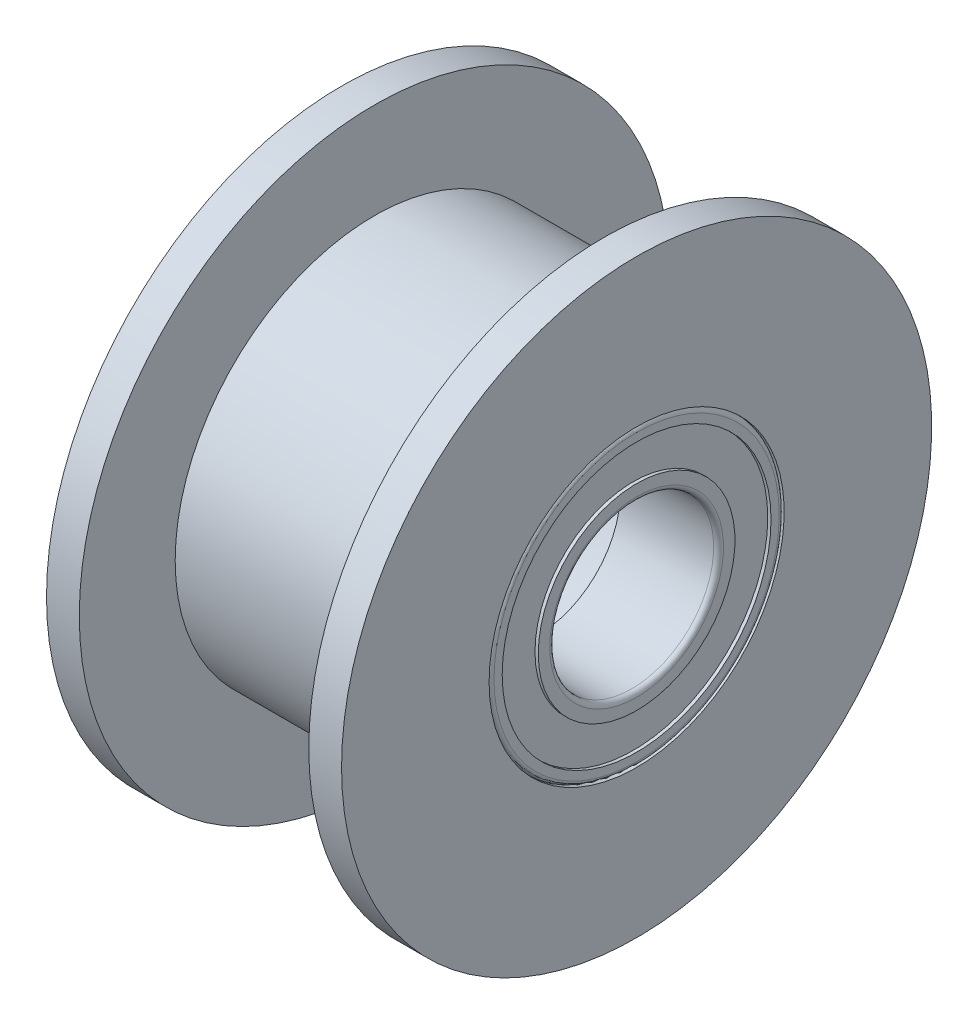
ISO-10303-21;
HEADER;
FILE_DESCRIPTION(('STEP AP214'),'2;1');
FILE_NAME('part.step','',(''),(''),'','','');
FILE_SCHEMA(('AUTOMOTIVE_DESIGN { 1 0 10303 214 1 1 1 1 }'));
ENDSEC;
DATA;
#1=APPLICATION_CONTEXT('core data for automotive mechanical design processes');
#2=APPLICATION_PROTOCOL_DEFINITION('international standard','automotive_design',2000,#1);
#3=PRODUCT_CONTEXT('',#1,'mechanical');
#4=PRODUCT('Part','Part','',(#3));
#5=PRODUCT_RELATED_PRODUCT_CATEGORY('part','',(#4));
#6=PRODUCT_DEFINITION_FORMATION('','',#4);
#7=PRODUCT_DEFINITION_CONTEXT('part definition',#1,'design');
#8=PRODUCT_DEFINITION('design','',#6,#7);
#9=PRODUCT_DEFINITION_SHAPE('','',#8);
#10=(LENGTH_UNIT() NAMED_UNIT(*) SI_UNIT(.MILLI.,.METRE.));
#11=(NAMED_UNIT(*) PLANE_ANGLE_UNIT() SI_UNIT($,.RADIAN.));
#12=(NAMED_UNIT(*) SI_UNIT($,.STERADIAN.) SOLID_ANGLE_UNIT());
#13=UNCERTAINTY_MEASURE_WITH_UNIT(LENGTH_MEASURE(1.E-05),#10,'distance_accuracy_value','');
#14=(GEOMETRIC_REPRESENTATION_CONTEXT(3) GLOBAL_UNCERTAINTY_ASSIGNED_CONTEXT((#13)) GLOBAL_UNIT_ASSIGNED_CONTEXT((#10,
#11,#12)) REPRESENTATION_CONTEXT('',''));
#15=CARTESIAN_POINT('',(0.,0.,0.));
#16=DIRECTION('',(0.,0.,1.));
#17=DIRECTION('',(1.,0.,0.));
#18=AXIS2_PLACEMENT_3D('',#15,#16,#17);
#19=CARTESIAN_POINT('',(-4.35,0.,0.));
#20=DIRECTION('',(1.,0.,0.));
#21=DIRECTION('',(0.,0.,1.));
#22=AXIS2_PLACEMENT_3D('',#19,#20,#21);
#23=TOROIDAL_SURFACE('',#22,2.65,0.15);
#24=CARTESIAN_POINT('',(-4.5,0.,0.));
#25=DIRECTION('',(-1.,0.,0.));
#26=DIRECTION('',(0.,0.,1.));
#27=AXIS2_PLACEMENT_3D('',#24,#25,#26);
#28=CIRCLE('',#27,2.65);
#29=CARTESIAN_POINT('',(-4.5,0.,2.65));
#30=VERTEX_POINT('',#29);
#31=EDGE_CURVE('E187',#30,#30,#28,.T.);
#32=ORIENTED_EDGE('',*,*,#31,.T.);
#33=EDGE_LOOP('',(#32));
#34=FACE_BOUND('',#33,.T.);
#35=CARTESIAN_POINT('',(-4.35,0.,0.));
#36=DIRECTION('',(1.,0.,0.));
#37=DIRECTION('',(0.,0.,1.));
#38=AXIS2_PLACEMENT_3D('',#35,#36,#37);
#39=CIRCLE('',#38,2.5);
#40=CARTESIAN_POINT('',(-4.35,0.,2.5));
#41=VERTEX_POINT('',#40);
#42=EDGE_CURVE('E195',#41,#41,#39,.T.);
#43=ORIENTED_EDGE('',*,*,#42,.T.);
#44=EDGE_LOOP('',(#43));
#45=FACE_BOUND('',#44,.T.);
#46=ADVANCED_FACE('F17',(#34,#45),#23,.T.);
#47=CARTESIAN_POINT('',(-4.5,0.,6.75));
#48=DIRECTION('',(1.,0.,0.));
#49=DIRECTION('',(0.,1.,0.));
#50=AXIS2_PLACEMENT_3D('',#47,#48,#49);
#51=PLANE('',#50);
#52=CARTESIAN_POINT('',(-4.5,0.,0.));
#53=DIRECTION('',(-1.,0.,0.));
#54=DIRECTION('',(0.,0.,1.));
#55=AXIS2_PLACEMENT_3D('',#52,#53,#54);
#56=CIRCLE('',#55,4.5);
#57=CARTESIAN_POINT('',(-4.5,0.,4.5));
#58=VERTEX_POINT('',#57);
#59=EDGE_CURVE('E11',#58,#58,#56,.T.);
#60=ORIENTED_EDGE('',*,*,#59,.F.);
#61=EDGE_LOOP('',(#60));
#62=FACE_BOUND('',#61,.T.);
#63=CARTESIAN_POINT('',(-4.5,0.,0.));
#64=DIRECTION('',(-1.,0.,0.));
#65=DIRECTION('',(0.,0.,1.));
#66=AXIS2_PLACEMENT_3D('',#63,#64,#65);
#67=CIRCLE('',#66,9.);
#68=CARTESIAN_POINT('',(-4.5,0.,9.));
#69=VERTEX_POINT('',#68);
#70=EDGE_CURVE('E172',#69,#69,#67,.T.);
#71=ORIENTED_EDGE('',*,*,#70,.T.);
#72=EDGE_LOOP('',(#71));
#73=FACE_BOUND('',#72,.T.);
#74=ADVANCED_FACE('F19',(#62,#73),#51,.F.);
#75=CARTESIAN_POINT('',(-2.25,0.,0.));
#76=DIRECTION('',(1.,0.,0.));
#77=DIRECTION('',(0.,0.,1.));
#78=AXIS2_PLACEMENT_3D('',#75,#76,#77);
#79=CYLINDRICAL_SURFACE('',#78,4.5);
#80=CARTESIAN_POINT('',(-4.35,0.,0.));
#81=DIRECTION('',(-1.,0.,0.));
#82=DIRECTION('',(0.,0.,1.));
#83=AXIS2_PLACEMENT_3D('',#80,#81,#82);
#84=CIRCLE('',#83,4.5);
#85=CARTESIAN_POINT('',(-4.35,0.,4.5));
#86=VERTEX_POINT('',#85);
#87=EDGE_CURVE('E28',#86,#86,#84,.T.);
#88=ORIENTED_EDGE('',*,*,#87,.F.);
#89=EDGE_LOOP('',(#88));
#90=FACE_BOUND('',#89,.T.);
#91=ORIENTED_EDGE('',*,*,#59,.T.);
#92=EDGE_LOOP('',(#91));
#93=FACE_BOUND('',#92,.T.);
#94=ADVANCED_FACE('F315',(#90,#93),#79,.F.);
#95=CARTESIAN_POINT('',(-4.35,0.,0.));
#96=DIRECTION('',(1.,0.,0.));
#97=DIRECTION('',(0.,0.,1.));
#98=AXIS2_PLACEMENT_3D('',#95,#96,#97);
#99=TOROIDAL_SURFACE('',#98,4.35,0.15);
#100=ORIENTED_EDGE('',*,*,#87,.T.);
#101=EDGE_LOOP('',(#100));
#102=FACE_BOUND('',#101,.T.);
#103=CARTESIAN_POINT('',(-4.5,0.,0.));
#104=DIRECTION('',(-1.,0.,0.));
#105=DIRECTION('',(0.,0.,1.));
#106=AXIS2_PLACEMENT_3D('',#103,#104,#105);
#107=CIRCLE('',#106,4.35);
#108=CARTESIAN_POINT('',(-4.5,0.,4.35));
#109=VERTEX_POINT('',#108);
#110=EDGE_CURVE('E155',#109,#109,#107,.T.);
#111=ORIENTED_EDGE('',*,*,#110,.F.);
#112=EDGE_LOOP('',(#111));
#113=FACE_BOUND('',#112,.T.);
#114=ADVANCED_FACE('F309',(#102,#113),#99,.T.);
#115=CARTESIAN_POINT('',(-4.5,0.,4.225));
#116=DIRECTION('',(1.,0.,0.));
#117=DIRECTION('',(0.,1.,0.));
#118=AXIS2_PLACEMENT_3D('',#115,#116,#117);
#119=PLANE('',#118);
#120=CARTESIAN_POINT('',(-4.5,0.,0.));
#121=DIRECTION('',(-1.,0.,0.));
#122=DIRECTION('',(0.,0.,1.));
#123=AXIS2_PLACEMENT_3D('',#120,#121,#122);
#124=CIRCLE('',#123,4.1);
#125=CARTESIAN_POINT('',(-4.5,0.,4.1));
#126=VERTEX_POINT('',#125);
#127=EDGE_CURVE('E151',#126,#126,#124,.T.);
#128=ORIENTED_EDGE('',*,*,#127,.F.);
#129=EDGE_LOOP('',(#128));
#130=FACE_BOUND('',#129,.T.);
#131=ORIENTED_EDGE('',*,*,#110,.T.);
#132=EDGE_LOOP('',(#131));
#133=FACE_BOUND('',#132,.T.);
#134=ADVANCED_FACE('F314',(#130,#133),#119,.F.);
#135=CARTESIAN_POINT('',(-2.25,0.,0.));
#136=DIRECTION('',(1.,0.,0.));
#137=DIRECTION('',(0.,0.,1.));
#138=AXIS2_PLACEMENT_3D('',#135,#136,#137);
#139=CYLINDRICAL_SURFACE('',#138,4.1);
#140=CARTESIAN_POINT('',(-4.4,0.,0.));
#141=DIRECTION('',(-1.,0.,0.));
#142=DIRECTION('',(0.,0.,1.));
#143=AXIS2_PLACEMENT_3D('',#140,#141,#142);
#144=CIRCLE('',#143,4.1);
#145=CARTESIAN_POINT('',(-4.4,0.,4.1));
#146=VERTEX_POINT('',#145);
#147=EDGE_CURVE('E156',#146,#146,#144,.T.);
#148=ORIENTED_EDGE('',*,*,#147,.F.);
#149=EDGE_LOOP('',(#148));
#150=FACE_BOUND('',#149,.T.);
#151=ORIENTED_EDGE('',*,*,#127,.T.);
#152=EDGE_LOOP('',(#151));
#153=FACE_BOUND('',#152,.T.);
#154=ADVANCED_FACE('F152',(#150,#153),#139,.F.);
#155=CARTESIAN_POINT('',(-4.4,0.,3.55));
#156=DIRECTION('',(1.,0.,0.));
#157=DIRECTION('',(0.,1.,0.));
#158=AXIS2_PLACEMENT_3D('',#155,#156,#157);
#159=PLANE('',#158);
#160=CARTESIAN_POINT('',(-4.4,0.,0.));
#161=DIRECTION('',(-1.,0.,0.));
#162=DIRECTION('',(0.,0.,1.));
#163=AXIS2_PLACEMENT_3D('',#160,#161,#162);
#164=CIRCLE('',#163,3.);
#165=CARTESIAN_POINT('',(-4.4,0.,3.));
#166=VERTEX_POINT('',#165);
#167=EDGE_CURVE('E163',#166,#166,#164,.T.);
#168=ORIENTED_EDGE('',*,*,#167,.F.);
#169=EDGE_LOOP('',(#168));
#170=FACE_BOUND('',#169,.T.);
#171=ORIENTED_EDGE('',*,*,#147,.T.);
#172=EDGE_LOOP('',(#171));
#173=FACE_BOUND('',#172,.T.);
#174=ADVANCED_FACE('F377',(#170,#173),#159,.F.);
#175=CARTESIAN_POINT('',(-2.25,0.,0.));
#176=DIRECTION('',(1.,0.,0.));
#177=DIRECTION('',(0.,0.,1.));
#178=AXIS2_PLACEMENT_3D('',#175,#176,#177);
#179=CYLINDRICAL_SURFACE('',#178,3.);
#180=CARTESIAN_POINT('',(-4.5,0.,0.));
#181=DIRECTION('',(-1.,0.,0.));
#182=DIRECTION('',(0.,0.,1.));
#183=AXIS2_PLACEMENT_3D('',#180,#181,#182);
#184=CIRCLE('',#183,3.);
#185=CARTESIAN_POINT('',(-4.5,0.,3.));
#186=VERTEX_POINT('',#185);
#187=EDGE_CURVE('E185',#186,#186,#184,.T.);
#188=ORIENTED_EDGE('',*,*,#187,.F.);
#189=EDGE_LOOP('',(#188));
#190=FACE_BOUND('',#189,.T.);
#191=ORIENTED_EDGE('',*,*,#167,.T.);
#192=EDGE_LOOP('',(#191));
#193=FACE_BOUND('',#192,.T.);
#194=ADVANCED_FACE('F288',(#190,#193),#179,.T.);
#195=CARTESIAN_POINT('',(-4.5,0.,2.75));
#196=DIRECTION('',(1.,0.,0.));
#197=DIRECTION('',(0.,1.,0.));
#198=AXIS2_PLACEMENT_3D('',#195,#196,#197);
#199=PLANE('',#198);
#200=ORIENTED_EDGE('',*,*,#187,.T.);
#201=EDGE_LOOP('',(#200));
#202=FACE_BOUND('',#201,.T.);
#203=ORIENTED_EDGE('',*,*,#31,.F.);
#204=EDGE_LOOP('',(#203));
#205=FACE_BOUND('',#204,.T.);
#206=ADVANCED_FACE('F282',(#202,#205),#199,.F.);
#207=CARTESIAN_POINT('',(-2.25,0.,0.));
#208=DIRECTION('',(1.,0.,0.));
#209=DIRECTION('',(0.,0.,1.));
#210=AXIS2_PLACEMENT_3D('',#207,#208,#209);
#211=CYLINDRICAL_SURFACE('',#210,2.5);
#212=CARTESIAN_POINT('',(-1.5,0.,0.));
#213=DIRECTION('',(-1.,0.,0.));
#214=DIRECTION('',(0.,0.,1.));
#215=AXIS2_PLACEMENT_3D('',#212,#213,#214);
#216=CIRCLE('',#215,2.5);
#217=CARTESIAN_POINT('',(-1.5,0.,2.5));
#218=VERTEX_POINT('',#217);
#219=EDGE_CURVE('E203',#218,#218,#216,.T.);
#220=ORIENTED_EDGE('',*,*,#219,.F.);
#221=EDGE_LOOP('',(#220));
#222=FACE_BOUND('',#221,.T.);
#223=ORIENTED_EDGE('',*,*,#42,.F.);
#224=EDGE_LOOP('',(#223));
#225=FACE_BOUND('',#224,.T.);
#226=ADVANCED_FACE('F287',(#222,#225),#211,.F.);
#227=CARTESIAN_POINT('',(-1.5,0.,3.375));
#228=DIRECTION('',(1.,0.,0.));
#229=DIRECTION('',(0.,1.,0.));
#230=AXIS2_PLACEMENT_3D('',#227,#228,#229);
#231=PLANE('',#230);
#232=ORIENTED_EDGE('',*,*,#219,.T.);
#233=EDGE_LOOP('',(#232));
#234=FACE_BOUND('',#233,.T.);
#235=CARTESIAN_POINT('',(-1.5,0.,0.));
#236=DIRECTION('',(-1.,0.,0.));
#237=DIRECTION('',(0.,0.,1.));
#238=AXIS2_PLACEMENT_3D('',#235,#236,#237);
#239=CIRCLE('',#238,4.25);
#240=CARTESIAN_POINT('',(-1.5,0.,4.25));
#241=VERTEX_POINT('',#240);
#242=EDGE_CURVE('E209',#241,#241,#239,.T.);
#243=ORIENTED_EDGE('',*,*,#242,.F.);
#244=EDGE_LOOP('',(#243));
#245=FACE_BOUND('',#244,.T.);
#246=ADVANCED_FACE('F366',(#234,#245),#231,.T.);
#247=CARTESIAN_POINT('',(-3.5,0.,7.5375));
#248=DIRECTION('',(-1.,0.,0.));
#249=DIRECTION('',(0.,0.,1.));
#250=AXIS2_PLACEMENT_3D('',#247,#248,#249);
#251=PLANE('',#250);
#252=CARTESIAN_POINT('',(-3.5,0.,0.));
#253=DIRECTION('',(-1.,0.,0.));
#254=DIRECTION('',(0.,0.,1.));
#255=AXIS2_PLACEMENT_3D('',#252,#253,#254);
#256=CIRCLE('',#255,9.);
#257=CARTESIAN_POINT('',(-3.5,0.,9.));
#258=VERTEX_POINT('',#257);
#259=EDGE_CURVE('E170',#258,#258,#256,.T.);
#260=ORIENTED_EDGE('',*,*,#259,.F.);
#261=EDGE_LOOP('',(#260));
#262=FACE_BOUND('',#261,.T.);
#263=CARTESIAN_POINT('',(-3.5,0.,0.));
#264=DIRECTION('',(-1.,0.,0.));
#265=DIRECTION('',(0.,0.,1.));
#266=AXIS2_PLACEMENT_3D('',#263,#264,#265);
#267=CIRCLE('',#266,6.075);
#268=CARTESIAN_POINT('',(-3.5,0.,6.075));
#269=VERTEX_POINT('',#268);
#270=EDGE_CURVE('E21',#269,#269,#267,.T.);
#271=ORIENTED_EDGE('',*,*,#270,.T.);
#272=EDGE_LOOP('',(#271));
#273=FACE_BOUND('',#272,.T.);
#274=ADVANCED_FACE('F360',(#262,#273),#251,.F.);
#275=CARTESIAN_POINT('',(-2.25,0.,0.));
#276=DIRECTION('',(1.,0.,0.));
#277=DIRECTION('',(0.,0.,1.));
#278=AXIS2_PLACEMENT_3D('',#275,#276,#277);
#279=CYLINDRICAL_SURFACE('',#278,9.);
#280=ORIENTED_EDGE('',*,*,#70,.F.);
#281=EDGE_LOOP('',(#280));
#282=FACE_BOUND('',#281,.T.);
#283=ORIENTED_EDGE('',*,*,#259,.T.);
#284=EDGE_LOOP('',(#283));
#285=FACE_BOUND('',#284,.T.);
#286=ADVANCED_FACE('F365',(#282,#285),#279,.T.);
#287=CARTESIAN_POINT('',(4.35,0.,0.));
#288=DIRECTION('',(-1.,0.,0.));
#289=DIRECTION('',(0.,0.,1.));
#290=AXIS2_PLACEMENT_3D('',#287,#288,#289);
#291=TOROIDAL_SURFACE('',#290,2.65,0.15);
#292=CARTESIAN_POINT('',(4.5,0.,0.));
#293=DIRECTION('',(-1.,0.,0.));
#294=DIRECTION('',(0.,0.,1.));
#295=AXIS2_PLACEMENT_3D('',#292,#293,#294);
#296=CIRCLE('',#295,2.65);
#297=CARTESIAN_POINT('',(4.5,0.,2.65));
#298=VERTEX_POINT('',#297);
#299=EDGE_CURVE('E138',#298,#298,#296,.T.);
#300=ORIENTED_EDGE('',*,*,#299,.F.);
#301=EDGE_LOOP('',(#300));
#302=FACE_BOUND('',#301,.T.);
#303=CARTESIAN_POINT('',(4.35,0.,0.));
#304=DIRECTION('',(1.,0.,0.));
#305=DIRECTION('',(0.,0.,1.));
#306=AXIS2_PLACEMENT_3D('',#303,#304,#305);
#307=CIRCLE('',#306,2.5);
#308=CARTESIAN_POINT('',(4.35,0.,2.5));
#309=VERTEX_POINT('',#308);
#310=EDGE_CURVE('E177',#309,#309,#307,.T.);
#311=ORIENTED_EDGE('',*,*,#310,.F.);
#312=EDGE_LOOP('',(#311));
#313=FACE_BOUND('',#312,.T.);
#314=ADVANCED_FACE('F301',(#302,#313),#291,.T.);
#315=CARTESIAN_POINT('',(4.5,0.,6.75));
#316=DIRECTION('',(-1.,0.,0.));
#317=DIRECTION('',(0.,0.,1.));
#318=AXIS2_PLACEMENT_3D('',#315,#316,#317);
#319=PLANE('',#318);
#320=CARTESIAN_POINT('',(4.5,0.,0.));
#321=DIRECTION('',(-1.,0.,0.));
#322=DIRECTION('',(0.,0.,1.));
#323=AXIS2_PLACEMENT_3D('',#320,#321,#322);
#324=CIRCLE('',#323,4.5);
#325=CARTESIAN_POINT('',(4.5,0.,4.5));
#326=VERTEX_POINT('',#325);
#327=EDGE_CURVE('E173',#326,#326,#324,.T.);
#328=ORIENTED_EDGE('',*,*,#327,.T.);
#329=EDGE_LOOP('',(#328));
#330=FACE_BOUND('',#329,.T.);
#331=CARTESIAN_POINT('',(4.5,0.,0.));
#332=DIRECTION('',(-1.,0.,0.));
#333=DIRECTION('',(0.,0.,1.));
#334=AXIS2_PLACEMENT_3D('',#331,#332,#333);
#335=CIRCLE('',#334,9.);
#336=CARTESIAN_POINT('',(4.5,0.,9.));
#337=VERTEX_POINT('',#336);
#338=EDGE_CURVE('E167',#337,#337,#335,.T.);
#339=ORIENTED_EDGE('',*,*,#338,.F.);
#340=EDGE_LOOP('',(#339));
#341=FACE_BOUND('',#340,.T.);
#342=ADVANCED_FACE('F295',(#330,#341),#319,.F.);
#343=CARTESIAN_POINT('',(2.25,0.,0.));
#344=DIRECTION('',(-1.,0.,0.));
#345=DIRECTION('',(0.,0.,1.));
#346=AXIS2_PLACEMENT_3D('',#343,#344,#345);
#347=CYLINDRICAL_SURFACE('',#346,4.5);
#348=CARTESIAN_POINT('',(4.35,0.,0.));
#349=DIRECTION('',(-1.,0.,0.));
#350=DIRECTION('',(0.,0.,1.));
#351=AXIS2_PLACEMENT_3D('',#348,#349,#350);
#352=CIRCLE('',#351,4.5);
#353=CARTESIAN_POINT('',(4.35,0.,4.5));
#354=VERTEX_POINT('',#353);
#355=EDGE_CURVE('E181',#354,#354,#352,.T.);
#356=ORIENTED_EDGE('',*,*,#355,.T.);
#357=EDGE_LOOP('',(#356));
#358=FACE_BOUND('',#357,.T.);
#359=ORIENTED_EDGE('',*,*,#327,.F.);
#360=EDGE_LOOP('',(#359));
#361=FACE_BOUND('',#360,.T.);
#362=ADVANCED_FACE('F300',(#358,#361),#347,.F.);
#363=CARTESIAN_POINT('',(4.35,0.,0.));
#364=DIRECTION('',(-1.,0.,0.));
#365=DIRECTION('',(0.,0.,1.));
#366=AXIS2_PLACEMENT_3D('',#363,#364,#365);
#367=TOROIDAL_SURFACE('',#366,4.35,0.15);
#368=ORIENTED_EDGE('',*,*,#355,.F.);
#369=EDGE_LOOP('',(#368));
#370=FACE_BOUND('',#369,.T.);
#371=CARTESIAN_POINT('',(4.5,0.,0.));
#372=DIRECTION('',(-1.,0.,0.));
#373=DIRECTION('',(0.,0.,1.));
#374=AXIS2_PLACEMENT_3D('',#371,#372,#373);
#375=CIRCLE('',#374,4.35);
#376=CARTESIAN_POINT('',(4.5,0.,4.35));
#377=VERTEX_POINT('',#376);
#378=EDGE_CURVE('E221',#377,#377,#375,.T.);
#379=ORIENTED_EDGE('',*,*,#378,.T.);
#380=EDGE_LOOP('',(#379));
#381=FACE_BOUND('',#380,.T.);
#382=ADVANCED_FACE('F354',(#370,#381),#367,.T.);
#383=CARTESIAN_POINT('',(4.5,0.,4.225));
#384=DIRECTION('',(-1.,0.,0.));
#385=DIRECTION('',(0.,0.,1.));
#386=AXIS2_PLACEMENT_3D('',#383,#384,#385);
#387=PLANE('',#386);
#388=CARTESIAN_POINT('',(4.5,0.,0.));
#389=DIRECTION('',(-1.,0.,0.));
#390=DIRECTION('',(0.,0.,1.));
#391=AXIS2_PLACEMENT_3D('',#388,#389,#390);
#392=CIRCLE('',#391,4.1);
#393=CARTESIAN_POINT('',(4.5,0.,4.1));
#394=VERTEX_POINT('',#393);
#395=EDGE_CURVE('E226',#394,#394,#392,.T.);
#396=ORIENTED_EDGE('',*,*,#395,.T.);
#397=EDGE_LOOP('',(#396));
#398=FACE_BOUND('',#397,.T.);
#399=ORIENTED_EDGE('',*,*,#378,.F.);
#400=EDGE_LOOP('',(#399));
#401=FACE_BOUND('',#400,.T.);
#402=ADVANCED_FACE('F435',(#398,#401),#387,.F.);
#403=CARTESIAN_POINT('',(2.25,0.,0.));
#404=DIRECTION('',(-1.,0.,0.));
#405=DIRECTION('',(0.,0.,1.));
#406=AXIS2_PLACEMENT_3D('',#403,#404,#405);
#407=CYLINDRICAL_SURFACE('',#406,4.1);
#408=CARTESIAN_POINT('',(4.4,0.,0.));
#409=DIRECTION('',(-1.,0.,0.));
#410=DIRECTION('',(0.,0.,1.));
#411=AXIS2_PLACEMENT_3D('',#408,#409,#410);
#412=CIRCLE('',#411,4.1);
#413=CARTESIAN_POINT('',(4.4,0.,4.1));
#414=VERTEX_POINT('',#413);
#415=EDGE_CURVE('E234',#414,#414,#412,.T.);
#416=ORIENTED_EDGE('',*,*,#415,.T.);
#417=EDGE_LOOP('',(#416));
#418=FACE_BOUND('',#417,.T.);
#419=ORIENTED_EDGE('',*,*,#395,.F.);
#420=EDGE_LOOP('',(#419));
#421=FACE_BOUND('',#420,.T.);
#422=ADVANCED_FACE('F453',(#418,#421),#407,.F.);
#423=CARTESIAN_POINT('',(4.4,0.,3.55));
#424=DIRECTION('',(-1.,0.,0.));
#425=DIRECTION('',(0.,0.,1.));
#426=AXIS2_PLACEMENT_3D('',#423,#424,#425);
#427=PLANE('',#426);
#428=CARTESIAN_POINT('',(4.4,0.,0.));
#429=DIRECTION('',(-1.,0.,0.));
#430=DIRECTION('',(0.,0.,1.));
#431=AXIS2_PLACEMENT_3D('',#428,#429,#430);
#432=CIRCLE('',#431,3.);
#433=CARTESIAN_POINT('',(4.4,0.,3.));
#434=VERTEX_POINT('',#433);
#435=EDGE_CURVE('E214',#434,#434,#432,.T.);
#436=ORIENTED_EDGE('',*,*,#435,.T.);
#437=EDGE_LOOP('',(#436));
#438=FACE_BOUND('',#437,.T.);
#439=ORIENTED_EDGE('',*,*,#415,.F.);
#440=EDGE_LOOP('',(#439));
#441=FACE_BOUND('',#440,.T.);
#442=ADVANCED_FACE('F484',(#438,#441),#427,.F.);
#443=CARTESIAN_POINT('',(2.25,0.,0.));
#444=DIRECTION('',(-1.,0.,0.));
#445=DIRECTION('',(0.,0.,1.));
#446=AXIS2_PLACEMENT_3D('',#443,#444,#445);
#447=CYLINDRICAL_SURFACE('',#446,3.);
#448=CARTESIAN_POINT('',(4.5,0.,0.));
#449=DIRECTION('',(-1.,0.,0.));
#450=DIRECTION('',(0.,0.,1.));
#451=AXIS2_PLACEMENT_3D('',#448,#449,#450);
#452=CIRCLE('',#451,3.);
#453=CARTESIAN_POINT('',(4.5,0.,3.));
#454=VERTEX_POINT('',#453);
#455=EDGE_CURVE('E126',#454,#454,#452,.T.);
#456=ORIENTED_EDGE('',*,*,#455,.T.);
#457=EDGE_LOOP('',(#456));
#458=FACE_BOUND('',#457,.T.);
#459=ORIENTED_EDGE('',*,*,#435,.F.);
#460=EDGE_LOOP('',(#459));
#461=FACE_BOUND('',#460,.T.);
#462=ADVANCED_FACE('F336',(#458,#461),#447,.T.);
#463=CARTESIAN_POINT('',(4.5,0.,2.75));
#464=DIRECTION('',(-1.,0.,0.));
#465=DIRECTION('',(0.,0.,1.));
#466=AXIS2_PLACEMENT_3D('',#463,#464,#465);
#467=PLANE('',#466);
#468=ORIENTED_EDGE('',*,*,#455,.F.);
#469=EDGE_LOOP('',(#468));
#470=FACE_BOUND('',#469,.T.);
#471=ORIENTED_EDGE('',*,*,#299,.T.);
#472=EDGE_LOOP('',(#471));
#473=FACE_BOUND('',#472,.T.);
#474=ADVANCED_FACE('F331',(#470,#473),#467,.F.);
#475=CARTESIAN_POINT('',(2.25,0.,0.));
#476=DIRECTION('',(-1.,0.,0.));
#477=DIRECTION('',(0.,0.,1.));
#478=AXIS2_PLACEMENT_3D('',#475,#476,#477);
#479=CYLINDRICAL_SURFACE('',#478,2.5);
#480=CARTESIAN_POINT('',(1.5,0.,0.));
#481=DIRECTION('',(-1.,0.,0.));
#482=DIRECTION('',(0.,0.,1.));
#483=AXIS2_PLACEMENT_3D('',#480,#481,#482);
#484=CIRCLE('',#483,2.5);
#485=CARTESIAN_POINT('',(1.5,0.,2.5));
#486=VERTEX_POINT('',#485);
#487=EDGE_CURVE('E207',#486,#486,#484,.T.);
#488=ORIENTED_EDGE('',*,*,#487,.T.);
#489=EDGE_LOOP('',(#488));
#490=FACE_BOUND('',#489,.T.);
#491=ORIENTED_EDGE('',*,*,#310,.T.);
#492=EDGE_LOOP('',(#491));
#493=FACE_BOUND('',#492,.T.);
#494=ADVANCED_FACE('F250',(#490,#493),#479,.F.);
#495=CARTESIAN_POINT('',(1.5,0.,3.375));
#496=DIRECTION('',(-1.,0.,0.));
#497=DIRECTION('',(0.,0.,1.));
#498=AXIS2_PLACEMENT_3D('',#495,#496,#497);
#499=PLANE('',#498);
#500=ORIENTED_EDGE('',*,*,#487,.F.);
#501=EDGE_LOOP('',(#500));
#502=FACE_BOUND('',#501,.T.);
#503=CARTESIAN_POINT('',(1.5,0.,0.));
#504=DIRECTION('',(-1.,0.,0.));
#505=DIRECTION('',(0.,0.,1.));
#506=AXIS2_PLACEMENT_3D('',#503,#504,#505);
#507=CIRCLE('',#506,4.25);
#508=CARTESIAN_POINT('',(1.5,0.,4.25));
#509=VERTEX_POINT('',#508);
#510=EDGE_CURVE('E211',#509,#509,#507,.T.);
#511=ORIENTED_EDGE('',*,*,#510,.T.);
#512=EDGE_LOOP('',(#511));
#513=FACE_BOUND('',#512,.T.);
#514=ADVANCED_FACE('F254',(#502,#513),#499,.T.);
#515=CARTESIAN_POINT('',(2.25,0.,0.));
#516=DIRECTION('',(-1.,0.,0.));
#517=DIRECTION('',(0.,0.,1.));
#518=AXIS2_PLACEMENT_3D('',#515,#516,#517);
#519=CYLINDRICAL_SURFACE('',#518,4.25);
#520=ORIENTED_EDGE('',*,*,#242,.T.);
#521=EDGE_LOOP('',(#520));
#522=FACE_BOUND('',#521,.T.);
#523=ORIENTED_EDGE('',*,*,#510,.F.);
#524=EDGE_LOOP('',(#523));
#525=FACE_BOUND('',#524,.T.);
#526=ADVANCED_FACE('F257',(#522,#525),#519,.F.);
#527=CARTESIAN_POINT('',(2.25,0.,0.));
#528=DIRECTION('',(-1.,0.,0.));
#529=DIRECTION('',(0.,0.,1.));
#530=AXIS2_PLACEMENT_3D('',#527,#528,#529);
#531=CYLINDRICAL_SURFACE('',#530,6.075);
#532=ORIENTED_EDGE('',*,*,#270,.F.);
#533=EDGE_LOOP('',(#532));
#534=FACE_BOUND('',#533,.T.);
#535=CARTESIAN_POINT('',(3.5,0.,0.));
#536=DIRECTION('',(-1.,0.,0.));
#537=DIRECTION('',(0.,0.,1.));
#538=AXIS2_PLACEMENT_3D('',#535,#536,#537);
#539=CIRCLE('',#538,6.075);
#540=CARTESIAN_POINT('',(3.5,0.,6.075));
#541=VERTEX_POINT('',#540);
#542=EDGE_CURVE('E83',#541,#541,#539,.T.);
#543=ORIENTED_EDGE('',*,*,#542,.T.);
#544=EDGE_LOOP('',(#543));
#545=FACE_BOUND('',#544,.T.);
#546=ADVANCED_FACE('F273',(#534,#545),#531,.T.);
#547=CARTESIAN_POINT('',(3.5,0.,7.5375));
#548=DIRECTION('',(1.,0.,0.));
#549=DIRECTION('',(0.,1.,0.));
#550=AXIS2_PLACEMENT_3D('',#547,#548,#549);
#551=PLANE('',#550);
#552=CARTESIAN_POINT('',(3.5,0.,0.));
#553=DIRECTION('',(-1.,0.,0.));
#554=DIRECTION('',(0.,0.,1.));
#555=AXIS2_PLACEMENT_3D('',#552,#553,#554);
#556=CIRCLE('',#555,9.);
#557=CARTESIAN_POINT('',(3.5,0.,9.));
#558=VERTEX_POINT('',#557);
#559=EDGE_CURVE('E169',#558,#558,#556,.T.);
#560=ORIENTED_EDGE('',*,*,#559,.T.);
#561=EDGE_LOOP('',(#560));
#562=FACE_BOUND('',#561,.T.);
#563=ORIENTED_EDGE('',*,*,#542,.F.);
#564=EDGE_LOOP('',(#563));
#565=FACE_BOUND('',#564,.T.);
#566=ADVANCED_FACE('F267',(#562,#565),#551,.F.);
#567=CARTESIAN_POINT('',(2.25,0.,0.));
#568=DIRECTION('',(-1.,0.,0.));
#569=DIRECTION('',(0.,0.,1.));
#570=AXIS2_PLACEMENT_3D('',#567,#568,#569);
#571=CYLINDRICAL_SURFACE('',#570,9.);
#572=ORIENTED_EDGE('',*,*,#338,.T.);
#573=EDGE_LOOP('',(#572));
#574=FACE_BOUND('',#573,.T.);
#575=ORIENTED_EDGE('',*,*,#559,.F.);
#576=EDGE_LOOP('',(#575));
#577=FACE_BOUND('',#576,.T.);
#578=ADVANCED_FACE('F272',(#574,#577),#571,.T.);
#579=CLOSED_SHELL('',(#46,#74,#94,#114,#134,#154,#174,#194,#206,#226,#246,#274,#286,#314,#342,
#362,#382,#402,#422,#442,#462,#474,#494,#514,#526,#546,#566,#578));
#580=MANIFOLD_SOLID_BREP('B1',#579);
#581=ADVANCED_BREP_SHAPE_REPRESENTATION('',(#18,#580),#14);
#582=SHAPE_DEFINITION_REPRESENTATION(#9,#581);
ENDSEC;
END-ISO-10303-21;
